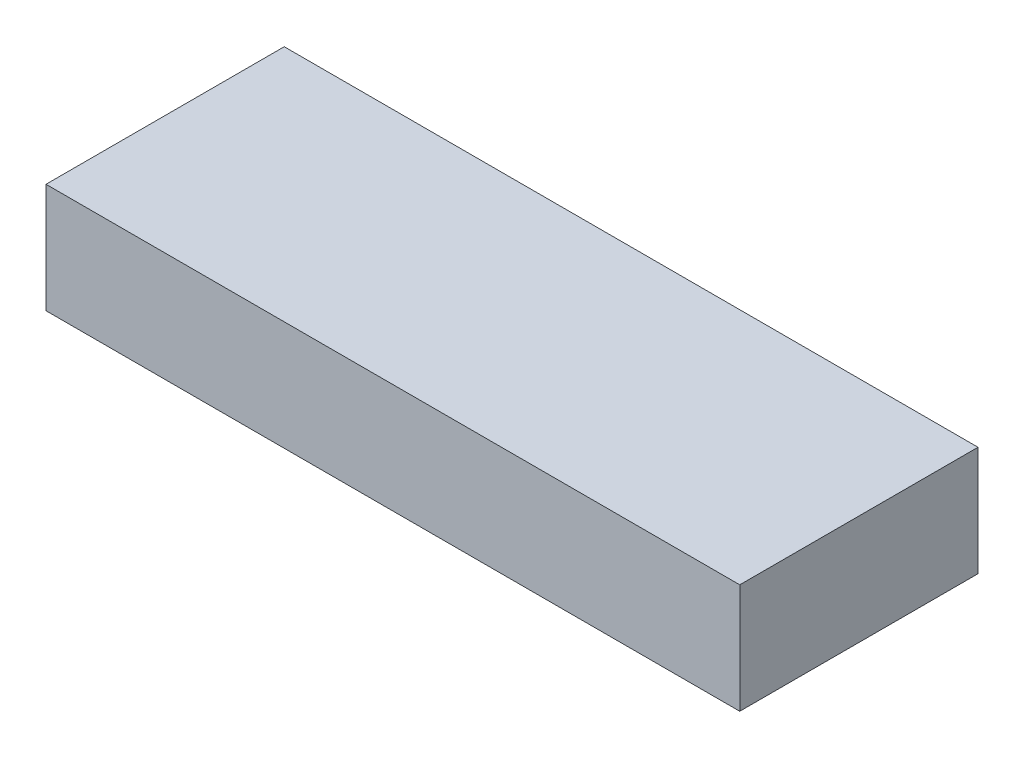
ISO-10303-21;
HEADER;
FILE_DESCRIPTION(('STEP AP214'),'2;1');
FILE_NAME('part.step','',(''),(''),'','','');
FILE_SCHEMA(('AUTOMOTIVE_DESIGN { 1 0 10303 214 1 1 1 1 }'));
ENDSEC;
DATA;
#1=APPLICATION_CONTEXT('core data for automotive mechanical design processes');
#2=APPLICATION_PROTOCOL_DEFINITION('international standard','automotive_design',2000,#1);
#3=PRODUCT_CONTEXT('',#1,'mechanical');
#4=PRODUCT('Part','Part','',(#3));
#5=PRODUCT_RELATED_PRODUCT_CATEGORY('part','',(#4));
#6=PRODUCT_DEFINITION_FORMATION('','',#4);
#7=PRODUCT_DEFINITION_CONTEXT('part definition',#1,'design');
#8=PRODUCT_DEFINITION('design','',#6,#7);
#9=PRODUCT_DEFINITION_SHAPE('','',#8);
#10=(LENGTH_UNIT() NAMED_UNIT(*) SI_UNIT(.MILLI.,.METRE.));
#11=(NAMED_UNIT(*) PLANE_ANGLE_UNIT() SI_UNIT($,.RADIAN.));
#12=(NAMED_UNIT(*) SI_UNIT($,.STERADIAN.) SOLID_ANGLE_UNIT());
#13=UNCERTAINTY_MEASURE_WITH_UNIT(LENGTH_MEASURE(1.E-05),#10,'distance_accuracy_value','');
#14=(GEOMETRIC_REPRESENTATION_CONTEXT(3) GLOBAL_UNCERTAINTY_ASSIGNED_CONTEXT((#13)) GLOBAL_UNIT_ASSIGNED_CONTEXT((#10,
#11,#12)) REPRESENTATION_CONTEXT('',''));
#15=CARTESIAN_POINT('',(0.,0.,0.));
#16=DIRECTION('',(0.,0.,1.));
#17=DIRECTION('',(1.,0.,0.));
#18=AXIS2_PLACEMENT_3D('',#15,#16,#17);
#19=CARTESIAN_POINT('',(0.,3.048,0.));
#20=DIRECTION('',(1.,0.,0.));
#21=DIRECTION('',(0.,0.,-1.));
#22=AXIS2_PLACEMENT_3D('',#19,#20,#21);
#23=PLANE('',#22);
#24=DIRECTION('',(0.,0.,1.));
#25=VECTOR('',#24,1.);
#26=CARTESIAN_POINT('',(0.,0.,0.));
#27=LINE('',#26,#25);
#28=CARTESIAN_POINT('',(0.,0.,-6.6294));
#29=VERTEX_POINT('',#28);
#30=CARTESIAN_POINT('',(0.,0.,0.));
#31=VERTEX_POINT('',#30);
#32=EDGE_CURVE('E96',#29,#31,#27,.T.);
#33=ORIENTED_EDGE('',*,*,#32,.T.);
#34=DIRECTION('',(0.,-1.,0.));
#35=VECTOR('',#34,1.);
#36=CARTESIAN_POINT('',(0.,3.048,0.));
#37=LINE('',#36,#35);
#38=CARTESIAN_POINT('',(0.,3.048,0.));
#39=VERTEX_POINT('',#38);
#40=EDGE_CURVE('E11',#39,#31,#37,.T.);
#41=ORIENTED_EDGE('',*,*,#40,.F.);
#42=DIRECTION('',(0.,0.,1.));
#43=VECTOR('',#42,1.);
#44=CARTESIAN_POINT('',(0.,3.048,0.));
#45=LINE('',#44,#43);
#46=CARTESIAN_POINT('',(0.,3.048,-6.6294));
#47=VERTEX_POINT('',#46);
#48=EDGE_CURVE('E84',#47,#39,#45,.T.);
#49=ORIENTED_EDGE('',*,*,#48,.F.);
#50=DIRECTION('',(0.,-1.,0.));
#51=VECTOR('',#50,1.);
#52=CARTESIAN_POINT('',(0.,3.048,-6.6294));
#53=LINE('',#52,#51);
#54=EDGE_CURVE('E92',#47,#29,#53,.T.);
#55=ORIENTED_EDGE('',*,*,#54,.T.);
#56=EDGE_LOOP('',(#33,#41,#49,#55));
#57=FACE_BOUND('',#56,.T.);
#58=ADVANCED_FACE('F33',(#57),#23,.F.);
#59=CARTESIAN_POINT('',(0.,3.048,0.));
#60=DIRECTION('',(0.,0.,-1.));
#61=DIRECTION('',(-1.,0.,0.));
#62=AXIS2_PLACEMENT_3D('',#59,#60,#61);
#63=PLANE('',#62);
#64=DIRECTION('',(1.,0.,0.));
#65=VECTOR('',#64,1.);
#66=CARTESIAN_POINT('',(0.,0.,0.));
#67=LINE('',#66,#65);
#68=CARTESIAN_POINT('',(19.304,0.,0.));
#69=VERTEX_POINT('',#68);
#70=EDGE_CURVE('E88',#31,#69,#67,.T.);
#71=ORIENTED_EDGE('',*,*,#70,.T.);
#72=DIRECTION('',(0.,-1.,0.));
#73=VECTOR('',#72,1.);
#74=CARTESIAN_POINT('',(19.304,3.048,0.));
#75=LINE('',#74,#73);
#76=CARTESIAN_POINT('',(19.304,3.048,0.));
#77=VERTEX_POINT('',#76);
#78=EDGE_CURVE('E41',#77,#69,#75,.T.);
#79=ORIENTED_EDGE('',*,*,#78,.F.);
#80=DIRECTION('',(1.,0.,0.));
#81=VECTOR('',#80,1.);
#82=CARTESIAN_POINT('',(0.,3.048,0.));
#83=LINE('',#82,#81);
#84=EDGE_CURVE('E79',#39,#77,#83,.T.);
#85=ORIENTED_EDGE('',*,*,#84,.F.);
#86=ORIENTED_EDGE('',*,*,#40,.T.);
#87=EDGE_LOOP('',(#71,#79,#85,#86));
#88=FACE_BOUND('',#87,.T.);
#89=ADVANCED_FACE('F87',(#88),#63,.F.);
#90=CARTESIAN_POINT('',(19.304,3.048,0.));
#91=DIRECTION('',(-1.,0.,0.));
#92=DIRECTION('',(0.,0.,1.));
#93=AXIS2_PLACEMENT_3D('',#90,#91,#92);
#94=PLANE('',#93);
#95=DIRECTION('',(0.,0.,-1.));
#96=VECTOR('',#95,1.);
#97=CARTESIAN_POINT('',(19.304,0.,0.));
#98=LINE('',#97,#96);
#99=CARTESIAN_POINT('',(19.304,0.,-6.6294));
#100=VERTEX_POINT('',#99);
#101=EDGE_CURVE('E66',#69,#100,#98,.T.);
#102=ORIENTED_EDGE('',*,*,#101,.T.);
#103=DIRECTION('',(0.,-1.,0.));
#104=VECTOR('',#103,1.);
#105=CARTESIAN_POINT('',(19.304,3.048,-6.6294));
#106=LINE('',#105,#104);
#107=CARTESIAN_POINT('',(19.304,3.048,-6.6294));
#108=VERTEX_POINT('',#107);
#109=EDGE_CURVE('E89',#108,#100,#106,.T.);
#110=ORIENTED_EDGE('',*,*,#109,.F.);
#111=DIRECTION('',(0.,0.,-1.));
#112=VECTOR('',#111,1.);
#113=CARTESIAN_POINT('',(19.304,3.048,0.));
#114=LINE('',#113,#112);
#115=EDGE_CURVE('E82',#77,#108,#114,.T.);
#116=ORIENTED_EDGE('',*,*,#115,.F.);
#117=ORIENTED_EDGE('',*,*,#78,.T.);
#118=EDGE_LOOP('',(#102,#110,#116,#117));
#119=FACE_BOUND('',#118,.T.);
#120=ADVANCED_FACE('F90',(#119),#94,.F.);
#121=CARTESIAN_POINT('',(0.,3.048,-6.6294));
#122=DIRECTION('',(0.,0.,1.));
#123=DIRECTION('',(1.,0.,0.));
#124=AXIS2_PLACEMENT_3D('',#121,#122,#123);
#125=PLANE('',#124);
#126=DIRECTION('',(-1.,0.,0.));
#127=VECTOR('',#126,1.);
#128=CARTESIAN_POINT('',(0.,0.,-6.6294));
#129=LINE('',#128,#127);
#130=EDGE_CURVE('E72',#100,#29,#129,.T.);
#131=ORIENTED_EDGE('',*,*,#130,.T.);
#132=ORIENTED_EDGE('',*,*,#54,.F.);
#133=DIRECTION('',(-1.,0.,0.));
#134=VECTOR('',#133,1.);
#135=CARTESIAN_POINT('',(0.,3.048,-6.6294));
#136=LINE('',#135,#134);
#137=EDGE_CURVE('E49',#108,#47,#136,.T.);
#138=ORIENTED_EDGE('',*,*,#137,.F.);
#139=ORIENTED_EDGE('',*,*,#109,.T.);
#140=EDGE_LOOP('',(#131,#132,#138,#139));
#141=FACE_BOUND('',#140,.T.);
#142=ADVANCED_FACE('F103',(#141),#125,.F.);
#143=CARTESIAN_POINT('',(0.,3.048,0.));
#144=DIRECTION('',(0.,-1.,0.));
#145=DIRECTION('',(0.,0.,-1.));
#146=AXIS2_PLACEMENT_3D('',#143,#144,#145);
#147=PLANE('',#146);
#148=ORIENTED_EDGE('',*,*,#48,.T.);
#149=ORIENTED_EDGE('',*,*,#84,.T.);
#150=ORIENTED_EDGE('',*,*,#115,.T.);
#151=ORIENTED_EDGE('',*,*,#137,.T.);
#152=EDGE_LOOP('',(#148,#149,#150,#151));
#153=FACE_BOUND('',#152,.T.);
#154=ADVANCED_FACE('F80',(#153),#147,.F.);
#155=CARTESIAN_POINT('',(0.,0.,0.));
#156=DIRECTION('',(0.,-1.,0.));
#157=DIRECTION('',(0.,0.,-1.));
#158=AXIS2_PLACEMENT_3D('',#155,#156,#157);
#159=PLANE('',#158);
#160=ORIENTED_EDGE('',*,*,#32,.F.);
#161=ORIENTED_EDGE('',*,*,#130,.F.);
#162=ORIENTED_EDGE('',*,*,#101,.F.);
#163=ORIENTED_EDGE('',*,*,#70,.F.);
#164=EDGE_LOOP('',(#160,#161,#162,#163));
#165=FACE_BOUND('',#164,.T.);
#166=ADVANCED_FACE('F106',(#165),#159,.T.);
#167=CLOSED_SHELL('',(#58,#89,#120,#142,#154,#166));
#168=MANIFOLD_SOLID_BREP('B2',#167);
#169=ADVANCED_BREP_SHAPE_REPRESENTATION('',(#18,#168),#14);
#170=SHAPE_DEFINITION_REPRESENTATION(#9,#169);
ENDSEC;
END-ISO-10303-21;
